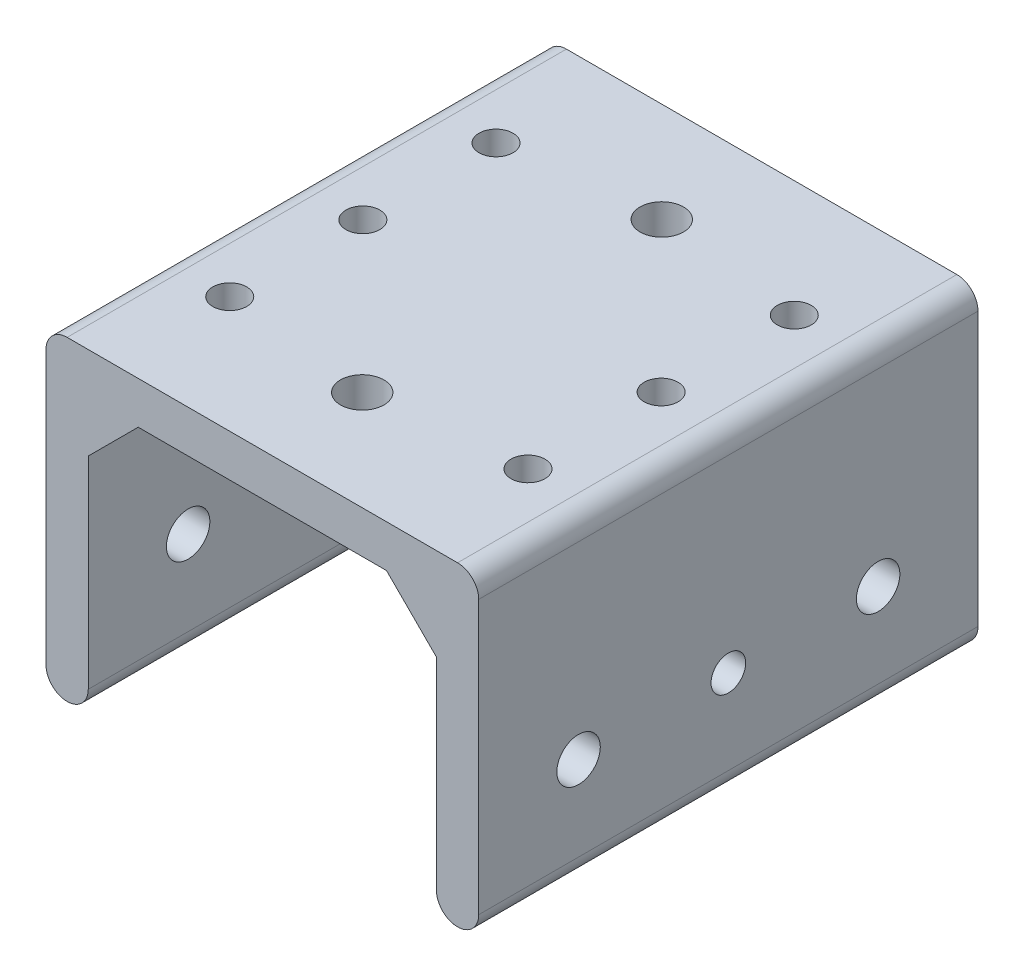
ISO-10303-21;
HEADER;
FILE_DESCRIPTION(('STEP AP214'),'2;1');
FILE_NAME('part.step','',(''),(''),'','','');
FILE_SCHEMA(('AUTOMOTIVE_DESIGN { 1 0 10303 214 1 1 1 1 }'));
ENDSEC;
DATA;
#1=APPLICATION_CONTEXT('core data for automotive mechanical design processes');
#2=APPLICATION_PROTOCOL_DEFINITION('international standard','automotive_design',2000,#1);
#3=PRODUCT_CONTEXT('',#1,'mechanical');
#4=PRODUCT('Part','Part','',(#3));
#5=PRODUCT_RELATED_PRODUCT_CATEGORY('part','',(#4));
#6=PRODUCT_DEFINITION_FORMATION('','',#4);
#7=PRODUCT_DEFINITION_CONTEXT('part definition',#1,'design');
#8=PRODUCT_DEFINITION('design','',#6,#7);
#9=PRODUCT_DEFINITION_SHAPE('','',#8);
#10=(LENGTH_UNIT() NAMED_UNIT(*) SI_UNIT(.MILLI.,.METRE.));
#11=(NAMED_UNIT(*) PLANE_ANGLE_UNIT() SI_UNIT($,.RADIAN.));
#12=(NAMED_UNIT(*) SI_UNIT($,.STERADIAN.) SOLID_ANGLE_UNIT());
#13=UNCERTAINTY_MEASURE_WITH_UNIT(LENGTH_MEASURE(1.E-05),#10,'distance_accuracy_value','');
#14=(GEOMETRIC_REPRESENTATION_CONTEXT(3) GLOBAL_UNCERTAINTY_ASSIGNED_CONTEXT((#13)) GLOBAL_UNIT_ASSIGNED_CONTEXT((#10,
#11,#12)) REPRESENTATION_CONTEXT('',''));
#15=CARTESIAN_POINT('',(0.,0.,0.));
#16=DIRECTION('',(0.,0.,1.));
#17=DIRECTION('',(1.,0.,0.));
#18=AXIS2_PLACEMENT_3D('',#15,#16,#17);
#19=CARTESIAN_POINT('',(6.35,0.,75.));
#20=DIRECTION('',(-1.,0.,0.));
#21=DIRECTION('',(0.,0.,1.));
#22=AXIS2_PLACEMENT_3D('',#19,#20,#21);
#23=PLANE('',#22);
#24=CARTESIAN_POINT('',(6.35,15.87,37.5));
#25=DIRECTION('',(-1.,0.,0.));
#26=DIRECTION('',(0.,0.,1.));
#27=AXIS2_PLACEMENT_3D('',#24,#25,#26);
#28=CIRCLE('',#27,2.6);
#29=CARTESIAN_POINT('',(6.35,15.87,40.1));
#30=VERTEX_POINT('',#29);
#31=EDGE_CURVE('E633',#30,#30,#28,.T.);
#32=ORIENTED_EDGE('',*,*,#31,.T.);
#33=EDGE_LOOP('',(#32));
#34=FACE_BOUND('',#33,.T.);
#35=CARTESIAN_POINT('',(6.35,15.87,60.));
#36=DIRECTION('',(-1.,0.,0.));
#37=DIRECTION('',(0.,0.,1.));
#38=AXIS2_PLACEMENT_3D('',#35,#36,#37);
#39=CIRCLE('',#38,3.2639);
#40=CARTESIAN_POINT('',(6.35,15.87,63.2639));
#41=VERTEX_POINT('',#40);
#42=EDGE_CURVE('E601',#41,#41,#39,.T.);
#43=ORIENTED_EDGE('',*,*,#42,.T.);
#44=EDGE_LOOP('',(#43));
#45=FACE_BOUND('',#44,.T.);
#46=CARTESIAN_POINT('',(6.35,15.87,15.));
#47=DIRECTION('',(-1.,0.,0.));
#48=DIRECTION('',(0.,0.,1.));
#49=AXIS2_PLACEMENT_3D('',#46,#47,#48);
#50=CIRCLE('',#49,3.2639);
#51=CARTESIAN_POINT('',(6.35,15.87,18.2639));
#52=VERTEX_POINT('',#51);
#53=EDGE_CURVE('E185',#52,#52,#50,.T.);
#54=ORIENTED_EDGE('',*,*,#53,.T.);
#55=EDGE_LOOP('',(#54));
#56=FACE_BOUND('',#55,.T.);
#57=DIRECTION('',(0.,1.,0.));
#58=VECTOR('',#57,1.);
#59=CARTESIAN_POINT('',(6.35,0.,75.));
#60=LINE('',#59,#58);
#61=CARTESIAN_POINT('',(6.35,3.175,75.));
#62=VERTEX_POINT('',#61);
#63=CARTESIAN_POINT('',(6.35,33.52,75.));
#64=VERTEX_POINT('',#63);
#65=EDGE_CURVE('E139',#62,#64,#60,.T.);
#66=ORIENTED_EDGE('',*,*,#65,.F.);
#67=DIRECTION('',(0.,0.,-1.));
#68=VECTOR('',#67,1.);
#69=CARTESIAN_POINT('',(6.35,3.175,75.));
#70=LINE('',#69,#68);
#71=CARTESIAN_POINT('',(6.35,3.175,0.));
#72=VERTEX_POINT('',#71);
#73=EDGE_CURVE('E240',#62,#72,#70,.T.);
#74=ORIENTED_EDGE('',*,*,#73,.T.);
#75=DIRECTION('',(0.,1.,0.));
#76=VECTOR('',#75,1.);
#77=CARTESIAN_POINT('',(6.35,0.,0.));
#78=LINE('',#77,#76);
#79=CARTESIAN_POINT('',(6.35,33.52,0.));
#80=VERTEX_POINT('',#79);
#81=EDGE_CURVE('E154',#72,#80,#78,.T.);
#82=ORIENTED_EDGE('',*,*,#81,.T.);
#83=DIRECTION('',(0.,0.,-1.));
#84=VECTOR('',#83,1.);
#85=CARTESIAN_POINT('',(6.35,33.52,75.));
#86=LINE('',#85,#84);
#87=EDGE_CURVE('E152',#64,#80,#86,.T.);
#88=ORIENTED_EDGE('',*,*,#87,.F.);
#89=EDGE_LOOP('',(#66,#74,#82,#88));
#90=FACE_BOUND('',#89,.T.);
#91=ADVANCED_FACE('F36',(#34,#45,#56,#90),#23,.F.);
#92=CARTESIAN_POINT('',(6.35,33.52,75.));
#93=DIRECTION('',(-0.707106781186548,0.707106781186548,0.));
#94=DIRECTION('',(-0.707106781186548,-0.707106781186548,0.));
#95=AXIS2_PLACEMENT_3D('',#92,#93,#94);
#96=PLANE('',#95);
#97=CARTESIAN_POINT('',(10.1,37.27,57.5));
#98=DIRECTION('',(-0.707106781186548,0.707106781186548,0.));
#99=DIRECTION('',(0.707106781186548,0.707106781186548,0.));
#100=AXIS2_PLACEMENT_3D('',#97,#98,#99);
#101=ELLIPSE('',#100,3.6100629606698,2.5527);
#102=CARTESIAN_POINT('',(12.6527,39.8227,57.5));
#103=VERTEX_POINT('',#102);
#104=EDGE_CURVE('E250',#103,#103,#101,.T.);
#105=ORIENTED_EDGE('',*,*,#104,.T.);
#106=EDGE_LOOP('',(#105));
#107=FACE_BOUND('',#106,.T.);
#108=CARTESIAN_POINT('',(10.1,37.27,37.5));
#109=DIRECTION('',(-0.707106781186548,0.707106781186548,0.));
#110=DIRECTION('',(0.707106781186548,0.707106781186548,0.));
#111=AXIS2_PLACEMENT_3D('',#108,#109,#110);
#112=ELLIPSE('',#111,3.6100629606698,2.5527);
#113=CARTESIAN_POINT('',(12.6527,39.8227,37.5));
#114=VERTEX_POINT('',#113);
#115=EDGE_CURVE('E668',#114,#114,#112,.T.);
#116=ORIENTED_EDGE('',*,*,#115,.T.);
#117=EDGE_LOOP('',(#116));
#118=FACE_BOUND('',#117,.T.);
#119=CARTESIAN_POINT('',(10.1,37.27,17.5));
#120=DIRECTION('',(-0.707106781186548,0.707106781186548,0.));
#121=DIRECTION('',(0.707106781186548,0.707106781186548,0.));
#122=AXIS2_PLACEMENT_3D('',#119,#120,#121);
#123=ELLIPSE('',#122,3.6100629606698,2.5527);
#124=CARTESIAN_POINT('',(12.6527,39.8227,17.5));
#125=VERTEX_POINT('',#124);
#126=EDGE_CURVE('E662',#125,#125,#123,.T.);
#127=ORIENTED_EDGE('',*,*,#126,.T.);
#128=EDGE_LOOP('',(#127));
#129=FACE_BOUND('',#128,.T.);
#130=DIRECTION('',(0.707106781186547,0.707106781186547,0.));
#131=VECTOR('',#130,1.);
#132=CARTESIAN_POINT('',(6.35,33.52,0.));
#133=LINE('',#132,#131);
#134=CARTESIAN_POINT('',(13.85,41.02,0.));
#135=VERTEX_POINT('',#134);
#136=EDGE_CURVE('E184',#80,#135,#133,.T.);
#137=ORIENTED_EDGE('',*,*,#136,.T.);
#138=DIRECTION('',(0.,0.,-1.));
#139=VECTOR('',#138,1.);
#140=CARTESIAN_POINT('',(13.85,41.02,75.));
#141=LINE('',#140,#139);
#142=CARTESIAN_POINT('',(13.85,41.02,75.));
#143=VERTEX_POINT('',#142);
#144=EDGE_CURVE('E158',#143,#135,#141,.T.);
#145=ORIENTED_EDGE('',*,*,#144,.F.);
#146=DIRECTION('',(0.707106781186547,0.707106781186547,0.));
#147=VECTOR('',#146,1.);
#148=CARTESIAN_POINT('',(6.35,33.52,75.));
#149=LINE('',#148,#147);
#150=EDGE_CURVE('E143',#64,#143,#149,.T.);
#151=ORIENTED_EDGE('',*,*,#150,.F.);
#152=ORIENTED_EDGE('',*,*,#87,.T.);
#153=EDGE_LOOP('',(#137,#145,#151,#152));
#154=FACE_BOUND('',#153,.T.);
#155=ADVANCED_FACE('F160',(#107,#118,#129,#154),#96,.F.);
#156=CARTESIAN_POINT('',(13.85,41.02,75.));
#157=DIRECTION('',(0.,1.,0.));
#158=DIRECTION('',(0.,0.,1.));
#159=AXIS2_PLACEMENT_3D('',#156,#157,#158);
#160=PLANE('',#159);
#161=CARTESIAN_POINT('',(32.5,41.02,15.));
#162=DIRECTION('',(0.,1.,0.));
#163=DIRECTION('',(0.,0.,1.));
#164=AXIS2_PLACEMENT_3D('',#161,#162,#163);
#165=CIRCLE('',#164,3.2639);
#166=CARTESIAN_POINT('',(32.5,41.02,18.2639));
#167=VERTEX_POINT('',#166);
#168=EDGE_CURVE('E627',#167,#167,#165,.T.);
#169=ORIENTED_EDGE('',*,*,#168,.T.);
#170=EDGE_LOOP('',(#169));
#171=FACE_BOUND('',#170,.T.);
#172=CARTESIAN_POINT('',(32.5,41.02,60.));
#173=DIRECTION('',(0.,1.,0.));
#174=DIRECTION('',(0.,0.,1.));
#175=AXIS2_PLACEMENT_3D('',#172,#173,#174);
#176=CIRCLE('',#175,3.2639);
#177=CARTESIAN_POINT('',(32.5,41.02,63.2639));
#178=VERTEX_POINT('',#177);
#179=EDGE_CURVE('E621',#178,#178,#176,.T.);
#180=ORIENTED_EDGE('',*,*,#179,.T.);
#181=EDGE_LOOP('',(#180));
#182=FACE_BOUND('',#181,.T.);
#183=DIRECTION('',(1.,0.,0.));
#184=VECTOR('',#183,1.);
#185=CARTESIAN_POINT('',(13.85,41.02,0.));
#186=LINE('',#185,#184);
#187=CARTESIAN_POINT('',(51.15,41.02,0.));
#188=VERTEX_POINT('',#187);
#189=EDGE_CURVE('E187',#135,#188,#186,.T.);
#190=ORIENTED_EDGE('',*,*,#189,.T.);
#191=DIRECTION('',(0.,0.,-1.));
#192=VECTOR('',#191,1.);
#193=CARTESIAN_POINT('',(51.15,41.02,75.));
#194=LINE('',#193,#192);
#195=CARTESIAN_POINT('',(51.15,41.02,75.));
#196=VERTEX_POINT('',#195);
#197=EDGE_CURVE('E205',#196,#188,#194,.T.);
#198=ORIENTED_EDGE('',*,*,#197,.F.);
#199=DIRECTION('',(1.,0.,0.));
#200=VECTOR('',#199,1.);
#201=CARTESIAN_POINT('',(13.85,41.02,75.));
#202=LINE('',#201,#200);
#203=EDGE_CURVE('E163',#143,#196,#202,.T.);
#204=ORIENTED_EDGE('',*,*,#203,.F.);
#205=ORIENTED_EDGE('',*,*,#144,.T.);
#206=EDGE_LOOP('',(#190,#198,#204,#205));
#207=FACE_BOUND('',#206,.T.);
#208=ADVANCED_FACE('F263',(#171,#182,#207),#160,.F.);
#209=CARTESIAN_POINT('',(58.65,33.52,75.));
#210=DIRECTION('',(-0.707106781186548,-0.707106781186548,0.));
#211=DIRECTION('',(0.707106781186548,-0.707106781186548,0.));
#212=AXIS2_PLACEMENT_3D('',#209,#210,#211);
#213=PLANE('',#212);
#214=CARTESIAN_POINT('',(54.9,37.27,57.5));
#215=DIRECTION('',(-0.707106781186548,-0.707106781186548,0.));
#216=DIRECTION('',(-0.707106781186548,0.707106781186548,0.));
#217=AXIS2_PLACEMENT_3D('',#214,#215,#216);
#218=ELLIPSE('',#217,3.6100629606698,2.5527);
#219=CARTESIAN_POINT('',(52.3473,39.8227,57.5));
#220=VERTEX_POINT('',#219);
#221=EDGE_CURVE('E656',#220,#220,#218,.T.);
#222=ORIENTED_EDGE('',*,*,#221,.F.);
#223=EDGE_LOOP('',(#222));
#224=FACE_BOUND('',#223,.T.);
#225=CARTESIAN_POINT('',(54.9,37.27,37.5));
#226=DIRECTION('',(-0.707106781186548,-0.707106781186548,0.));
#227=DIRECTION('',(-0.707106781186548,0.707106781186548,0.));
#228=AXIS2_PLACEMENT_3D('',#225,#226,#227);
#229=ELLIPSE('',#228,3.6100629606698,2.5527);
#230=CARTESIAN_POINT('',(52.3473,39.8227,37.5));
#231=VERTEX_POINT('',#230);
#232=EDGE_CURVE('E650',#231,#231,#229,.T.);
#233=ORIENTED_EDGE('',*,*,#232,.F.);
#234=EDGE_LOOP('',(#233));
#235=FACE_BOUND('',#234,.T.);
#236=CARTESIAN_POINT('',(54.9,37.27,17.5));
#237=DIRECTION('',(-0.707106781186548,-0.707106781186548,0.));
#238=DIRECTION('',(-0.707106781186548,0.707106781186548,0.));
#239=AXIS2_PLACEMENT_3D('',#236,#237,#238);
#240=ELLIPSE('',#239,3.6100629606698,2.5527);
#241=CARTESIAN_POINT('',(52.3473,39.8227,17.5));
#242=VERTEX_POINT('',#241);
#243=EDGE_CURVE('E642',#242,#242,#240,.T.);
#244=ORIENTED_EDGE('',*,*,#243,.F.);
#245=EDGE_LOOP('',(#244));
#246=FACE_BOUND('',#245,.T.);
#247=DIRECTION('',(-0.707106781186547,0.707106781186547,0.));
#248=VECTOR('',#247,1.);
#249=CARTESIAN_POINT('',(58.65,33.52,0.));
#250=LINE('',#249,#248);
#251=CARTESIAN_POINT('',(58.65,33.52,0.));
#252=VERTEX_POINT('',#251);
#253=EDGE_CURVE('E190',#252,#188,#250,.T.);
#254=ORIENTED_EDGE('',*,*,#253,.F.);
#255=DIRECTION('',(0.,0.,-1.));
#256=VECTOR('',#255,1.);
#257=CARTESIAN_POINT('',(58.65,33.52,75.));
#258=LINE('',#257,#256);
#259=CARTESIAN_POINT('',(58.65,33.52,75.));
#260=VERTEX_POINT('',#259);
#261=EDGE_CURVE('E182',#260,#252,#258,.T.);
#262=ORIENTED_EDGE('',*,*,#261,.F.);
#263=DIRECTION('',(-0.707106781186547,0.707106781186547,0.));
#264=VECTOR('',#263,1.);
#265=CARTESIAN_POINT('',(58.65,33.52,75.));
#266=LINE('',#265,#264);
#267=EDGE_CURVE('E165',#260,#196,#266,.T.);
#268=ORIENTED_EDGE('',*,*,#267,.T.);
#269=ORIENTED_EDGE('',*,*,#197,.T.);
#270=EDGE_LOOP('',(#254,#262,#268,#269));
#271=FACE_BOUND('',#270,.T.);
#272=ADVANCED_FACE('F270',(#224,#235,#246,#271),#213,.T.);
#273=CARTESIAN_POINT('',(58.65,33.52,75.));
#274=DIRECTION('',(1.,0.,0.));
#275=DIRECTION('',(0.,1.,0.));
#276=AXIS2_PLACEMENT_3D('',#273,#274,#275);
#277=PLANE('',#276);
#278=CARTESIAN_POINT('',(58.65,15.87,37.5));
#279=DIRECTION('',(1.,0.,0.));
#280=DIRECTION('',(0.,1.,0.));
#281=AXIS2_PLACEMENT_3D('',#278,#279,#280);
#282=CIRCLE('',#281,2.6);
#283=CARTESIAN_POINT('',(58.65,18.47,37.5));
#284=VERTEX_POINT('',#283);
#285=EDGE_CURVE('E635',#284,#284,#282,.T.);
#286=ORIENTED_EDGE('',*,*,#285,.T.);
#287=EDGE_LOOP('',(#286));
#288=FACE_BOUND('',#287,.T.);
#289=CARTESIAN_POINT('',(58.65,15.87,60.));
#290=DIRECTION('',(1.,0.,0.));
#291=DIRECTION('',(0.,1.,0.));
#292=AXIS2_PLACEMENT_3D('',#289,#290,#291);
#293=CIRCLE('',#292,3.2639);
#294=CARTESIAN_POINT('',(58.65,19.1339,60.));
#295=VERTEX_POINT('',#294);
#296=EDGE_CURVE('E615',#295,#295,#293,.T.);
#297=ORIENTED_EDGE('',*,*,#296,.T.);
#298=EDGE_LOOP('',(#297));
#299=FACE_BOUND('',#298,.T.);
#300=CARTESIAN_POINT('',(58.65,15.87,15.));
#301=DIRECTION('',(1.,0.,0.));
#302=DIRECTION('',(0.,1.,0.));
#303=AXIS2_PLACEMENT_3D('',#300,#301,#302);
#304=CIRCLE('',#303,3.2639);
#305=CARTESIAN_POINT('',(58.65,19.1339,15.));
#306=VERTEX_POINT('',#305);
#307=EDGE_CURVE('E609',#306,#306,#304,.T.);
#308=ORIENTED_EDGE('',*,*,#307,.T.);
#309=EDGE_LOOP('',(#308));
#310=FACE_BOUND('',#309,.T.);
#311=DIRECTION('',(0.,-1.,0.));
#312=VECTOR('',#311,1.);
#313=CARTESIAN_POINT('',(58.65,33.52,0.));
#314=LINE('',#313,#312);
#315=CARTESIAN_POINT('',(58.65,3.175,0.));
#316=VERTEX_POINT('',#315);
#317=EDGE_CURVE('E193',#252,#316,#314,.T.);
#318=ORIENTED_EDGE('',*,*,#317,.T.);
#319=DIRECTION('',(0.,0.,-1.));
#320=VECTOR('',#319,1.);
#321=CARTESIAN_POINT('',(58.65,3.175,75.));
#322=LINE('',#321,#320);
#323=CARTESIAN_POINT('',(58.65,3.175,75.));
#324=VERTEX_POINT('',#323);
#325=EDGE_CURVE('E233',#316,#324,#322,.F.);
#326=ORIENTED_EDGE('',*,*,#325,.T.);
#327=DIRECTION('',(0.,-1.,0.));
#328=VECTOR('',#327,1.);
#329=CARTESIAN_POINT('',(58.65,33.52,75.));
#330=LINE('',#329,#328);
#331=EDGE_CURVE('E171',#260,#324,#330,.T.);
#332=ORIENTED_EDGE('',*,*,#331,.F.);
#333=ORIENTED_EDGE('',*,*,#261,.T.);
#334=EDGE_LOOP('',(#318,#326,#332,#333));
#335=FACE_BOUND('',#334,.T.);
#336=ADVANCED_FACE('F273',(#288,#299,#310,#335),#277,.F.);
#337=CARTESIAN_POINT('',(65.,41.02,75.));
#338=DIRECTION('',(-1.,0.,0.));
#339=DIRECTION('',(0.,0.,1.));
#340=AXIS2_PLACEMENT_3D('',#337,#338,#339);
#341=PLANE('',#340);
#342=CARTESIAN_POINT('',(65.,15.87,37.5));
#343=DIRECTION('',(-1.,0.,0.));
#344=DIRECTION('',(0.,0.,1.));
#345=AXIS2_PLACEMENT_3D('',#342,#343,#344);
#346=CIRCLE('',#345,2.6);
#347=CARTESIAN_POINT('',(65.,15.87,40.1));
#348=VERTEX_POINT('',#347);
#349=EDGE_CURVE('E638',#348,#348,#346,.T.);
#350=ORIENTED_EDGE('',*,*,#349,.T.);
#351=EDGE_LOOP('',(#350));
#352=FACE_BOUND('',#351,.T.);
#353=CARTESIAN_POINT('',(65.,15.87,60.));
#354=DIRECTION('',(1.,0.,0.));
#355=DIRECTION('',(0.,0.,-1.));
#356=AXIS2_PLACEMENT_3D('',#353,#354,#355);
#357=CIRCLE('',#356,3.26389999999999);
#358=CARTESIAN_POINT('',(65.,15.87,56.7361));
#359=VERTEX_POINT('',#358);
#360=EDGE_CURVE('E618',#359,#359,#357,.T.);
#361=ORIENTED_EDGE('',*,*,#360,.F.);
#362=EDGE_LOOP('',(#361));
#363=FACE_BOUND('',#362,.T.);
#364=CARTESIAN_POINT('',(65.,15.87,15.));
#365=DIRECTION('',(1.,0.,0.));
#366=DIRECTION('',(0.,0.,-1.));
#367=AXIS2_PLACEMENT_3D('',#364,#365,#366);
#368=CIRCLE('',#367,3.26389999999999);
#369=CARTESIAN_POINT('',(65.,15.87,11.7361));
#370=VERTEX_POINT('',#369);
#371=EDGE_CURVE('E612',#370,#370,#368,.T.);
#372=ORIENTED_EDGE('',*,*,#371,.F.);
#373=EDGE_LOOP('',(#372));
#374=FACE_BOUND('',#373,.T.);
#375=DIRECTION('',(0.,-1.,0.));
#376=VECTOR('',#375,1.);
#377=CARTESIAN_POINT('',(65.,41.02,75.));
#378=LINE('',#377,#376);
#379=CARTESIAN_POINT('',(65.,44.195,75.));
#380=VERTEX_POINT('',#379);
#381=CARTESIAN_POINT('',(65.,3.175,75.));
#382=VERTEX_POINT('',#381);
#383=EDGE_CURVE('E174',#380,#382,#378,.T.);
#384=ORIENTED_EDGE('',*,*,#383,.T.);
#385=DIRECTION('',(0.,0.,-1.));
#386=VECTOR('',#385,1.);
#387=CARTESIAN_POINT('',(65.,3.175,0.));
#388=LINE('',#387,#386);
#389=CARTESIAN_POINT('',(65.,3.175,0.));
#390=VERTEX_POINT('',#389);
#391=EDGE_CURVE('E209',#382,#390,#388,.T.);
#392=ORIENTED_EDGE('',*,*,#391,.T.);
#393=DIRECTION('',(0.,1.,0.));
#394=VECTOR('',#393,1.);
#395=CARTESIAN_POINT('',(65.,41.02,0.));
#396=LINE('',#395,#394);
#397=CARTESIAN_POINT('',(65.,44.195,0.));
#398=VERTEX_POINT('',#397);
#399=EDGE_CURVE('E196',#390,#398,#396,.T.);
#400=ORIENTED_EDGE('',*,*,#399,.T.);
#401=DIRECTION('',(0.,0.,-1.));
#402=VECTOR('',#401,1.);
#403=CARTESIAN_POINT('',(65.,44.195,75.));
#404=LINE('',#403,#402);
#405=EDGE_CURVE('E157',#398,#380,#404,.F.);
#406=ORIENTED_EDGE('',*,*,#405,.T.);
#407=EDGE_LOOP('',(#384,#392,#400,#406));
#408=FACE_BOUND('',#407,.T.);
#409=ADVANCED_FACE('F282',(#352,#363,#374,#408),#341,.F.);
#410=CARTESIAN_POINT('',(0.,47.37,75.));
#411=DIRECTION('',(0.,1.,0.));
#412=DIRECTION('',(0.,0.,1.));
#413=AXIS2_PLACEMENT_3D('',#410,#411,#412);
#414=PLANE('',#413);
#415=CARTESIAN_POINT('',(10.1,47.37,57.5));
#416=DIRECTION('',(0.,1.,0.));
#417=DIRECTION('',(0.,0.,1.));
#418=AXIS2_PLACEMENT_3D('',#415,#416,#417);
#419=CIRCLE('',#418,2.5527);
#420=CARTESIAN_POINT('',(10.1,47.37,60.0527));
#421=VERTEX_POINT('',#420);
#422=EDGE_CURVE('E245',#421,#421,#419,.T.);
#423=ORIENTED_EDGE('',*,*,#422,.F.);
#424=EDGE_LOOP('',(#423));
#425=FACE_BOUND('',#424,.T.);
#426=CARTESIAN_POINT('',(10.1,47.37,37.5));
#427=DIRECTION('',(0.,1.,0.));
#428=DIRECTION('',(0.,0.,1.));
#429=AXIS2_PLACEMENT_3D('',#426,#427,#428);
#430=CIRCLE('',#429,2.5527);
#431=CARTESIAN_POINT('',(10.1,47.37,40.0527));
#432=VERTEX_POINT('',#431);
#433=EDGE_CURVE('E671',#432,#432,#430,.T.);
#434=ORIENTED_EDGE('',*,*,#433,.F.);
#435=EDGE_LOOP('',(#434));
#436=FACE_BOUND('',#435,.T.);
#437=CARTESIAN_POINT('',(10.1,47.37,17.5));
#438=DIRECTION('',(0.,1.,0.));
#439=DIRECTION('',(0.,0.,1.));
#440=AXIS2_PLACEMENT_3D('',#437,#438,#439);
#441=CIRCLE('',#440,2.5527);
#442=CARTESIAN_POINT('',(10.1,47.37,20.0527));
#443=VERTEX_POINT('',#442);
#444=EDGE_CURVE('E665',#443,#443,#441,.T.);
#445=ORIENTED_EDGE('',*,*,#444,.F.);
#446=EDGE_LOOP('',(#445));
#447=FACE_BOUND('',#446,.T.);
#448=CARTESIAN_POINT('',(54.9,47.37,57.5));
#449=DIRECTION('',(0.,1.,0.));
#450=DIRECTION('',(0.,0.,1.));
#451=AXIS2_PLACEMENT_3D('',#448,#449,#450);
#452=CIRCLE('',#451,2.5527);
#453=CARTESIAN_POINT('',(54.9,47.37,60.0527));
#454=VERTEX_POINT('',#453);
#455=EDGE_CURVE('E659',#454,#454,#452,.T.);
#456=ORIENTED_EDGE('',*,*,#455,.F.);
#457=EDGE_LOOP('',(#456));
#458=FACE_BOUND('',#457,.T.);
#459=CARTESIAN_POINT('',(54.9,47.37,37.5));
#460=DIRECTION('',(0.,1.,0.));
#461=DIRECTION('',(0.,0.,1.));
#462=AXIS2_PLACEMENT_3D('',#459,#460,#461);
#463=CIRCLE('',#462,2.5527);
#464=CARTESIAN_POINT('',(54.9,47.37,40.0527));
#465=VERTEX_POINT('',#464);
#466=EDGE_CURVE('E653',#465,#465,#463,.T.);
#467=ORIENTED_EDGE('',*,*,#466,.F.);
#468=EDGE_LOOP('',(#467));
#469=FACE_BOUND('',#468,.T.);
#470=CARTESIAN_POINT('',(54.9,47.37,17.5));
#471=DIRECTION('',(0.,1.,0.));
#472=DIRECTION('',(0.,0.,1.));
#473=AXIS2_PLACEMENT_3D('',#470,#471,#472);
#474=CIRCLE('',#473,2.5527);
#475=CARTESIAN_POINT('',(54.9,47.37,20.0527));
#476=VERTEX_POINT('',#475);
#477=EDGE_CURVE('E647',#476,#476,#474,.T.);
#478=ORIENTED_EDGE('',*,*,#477,.F.);
#479=EDGE_LOOP('',(#478));
#480=FACE_BOUND('',#479,.T.);
#481=CARTESIAN_POINT('',(32.5,47.37,15.));
#482=DIRECTION('',(0.,1.,0.));
#483=DIRECTION('',(0.,0.,1.));
#484=AXIS2_PLACEMENT_3D('',#481,#482,#483);
#485=CIRCLE('',#484,3.2639);
#486=CARTESIAN_POINT('',(32.5,47.37,18.2639));
#487=VERTEX_POINT('',#486);
#488=EDGE_CURVE('E630',#487,#487,#485,.T.);
#489=ORIENTED_EDGE('',*,*,#488,.F.);
#490=EDGE_LOOP('',(#489));
#491=FACE_BOUND('',#490,.T.);
#492=CARTESIAN_POINT('',(32.5,47.37,60.));
#493=DIRECTION('',(0.,1.,0.));
#494=DIRECTION('',(0.,0.,1.));
#495=AXIS2_PLACEMENT_3D('',#492,#493,#494);
#496=CIRCLE('',#495,3.2639);
#497=CARTESIAN_POINT('',(32.5,47.37,63.2639));
#498=VERTEX_POINT('',#497);
#499=EDGE_CURVE('E624',#498,#498,#496,.T.);
#500=ORIENTED_EDGE('',*,*,#499,.F.);
#501=EDGE_LOOP('',(#500));
#502=FACE_BOUND('',#501,.T.);
#503=DIRECTION('',(1.,0.,0.));
#504=VECTOR('',#503,1.);
#505=CARTESIAN_POINT('',(0.,47.37,0.));
#506=LINE('',#505,#504);
#507=CARTESIAN_POINT('',(3.175,47.37,0.));
#508=VERTEX_POINT('',#507);
#509=CARTESIAN_POINT('',(61.825,47.37,0.));
#510=VERTEX_POINT('',#509);
#511=EDGE_CURVE('E199',#508,#510,#506,.T.);
#512=ORIENTED_EDGE('',*,*,#511,.F.);
#513=DIRECTION('',(0.,0.,-1.));
#514=VECTOR('',#513,1.);
#515=CARTESIAN_POINT('',(3.175,47.37,75.));
#516=LINE('',#515,#514);
#517=CARTESIAN_POINT('',(3.175,47.37,75.));
#518=VERTEX_POINT('',#517);
#519=EDGE_CURVE('E11',#508,#518,#516,.F.);
#520=ORIENTED_EDGE('',*,*,#519,.T.);
#521=DIRECTION('',(1.,0.,0.));
#522=VECTOR('',#521,1.);
#523=CARTESIAN_POINT('',(0.,47.37,75.));
#524=LINE('',#523,#522);
#525=CARTESIAN_POINT('',(61.825,47.37,75.));
#526=VERTEX_POINT('',#525);
#527=EDGE_CURVE('E177',#518,#526,#524,.T.);
#528=ORIENTED_EDGE('',*,*,#527,.T.);
#529=DIRECTION('',(0.,0.,-1.));
#530=VECTOR('',#529,1.);
#531=CARTESIAN_POINT('',(61.825,47.37,0.));
#532=LINE('',#531,#530);
#533=EDGE_CURVE('E45',#526,#510,#532,.T.);
#534=ORIENTED_EDGE('',*,*,#533,.T.);
#535=EDGE_LOOP('',(#512,#520,#528,#534));
#536=FACE_BOUND('',#535,.T.);
#537=ADVANCED_FACE('F289',(#425,#436,#447,#458,#469,#480,#491,#502,#536),#414,.T.);
#538=CARTESIAN_POINT('',(0.,0.,75.));
#539=DIRECTION('',(-1.,0.,0.));
#540=DIRECTION('',(0.,0.,1.));
#541=AXIS2_PLACEMENT_3D('',#538,#539,#540);
#542=PLANE('',#541);
#543=CARTESIAN_POINT('',(0.,15.87,37.5));
#544=DIRECTION('',(-1.,0.,0.));
#545=DIRECTION('',(0.,0.,1.));
#546=AXIS2_PLACEMENT_3D('',#543,#544,#545);
#547=CIRCLE('',#546,2.6);
#548=CARTESIAN_POINT('',(0.,15.87,40.1));
#549=VERTEX_POINT('',#548);
#550=EDGE_CURVE('E639',#549,#549,#547,.T.);
#551=ORIENTED_EDGE('',*,*,#550,.F.);
#552=EDGE_LOOP('',(#551));
#553=FACE_BOUND('',#552,.T.);
#554=CARTESIAN_POINT('',(0.,15.87,60.));
#555=DIRECTION('',(-1.,0.,0.));
#556=DIRECTION('',(0.,0.,1.));
#557=AXIS2_PLACEMENT_3D('',#554,#555,#556);
#558=CIRCLE('',#557,3.26389999999999);
#559=CARTESIAN_POINT('',(0.,15.87,63.2639));
#560=VERTEX_POINT('',#559);
#561=EDGE_CURVE('E604',#560,#560,#558,.T.);
#562=ORIENTED_EDGE('',*,*,#561,.F.);
#563=EDGE_LOOP('',(#562));
#564=FACE_BOUND('',#563,.T.);
#565=CARTESIAN_POINT('',(0.,15.87,15.));
#566=DIRECTION('',(-1.,0.,0.));
#567=DIRECTION('',(0.,0.,1.));
#568=AXIS2_PLACEMENT_3D('',#565,#566,#567);
#569=CIRCLE('',#568,3.26389999999999);
#570=CARTESIAN_POINT('',(0.,15.87,18.2639));
#571=VERTEX_POINT('',#570);
#572=EDGE_CURVE('E599',#571,#571,#569,.T.);
#573=ORIENTED_EDGE('',*,*,#572,.F.);
#574=EDGE_LOOP('',(#573));
#575=FACE_BOUND('',#574,.T.);
#576=DIRECTION('',(0.,1.,0.));
#577=VECTOR('',#576,1.);
#578=CARTESIAN_POINT('',(0.,0.,0.));
#579=LINE('',#578,#577);
#580=CARTESIAN_POINT('',(0.,3.175,0.));
#581=VERTEX_POINT('',#580);
#582=CARTESIAN_POINT('',(0.,44.195,0.));
#583=VERTEX_POINT('',#582);
#584=EDGE_CURVE('E149',#581,#583,#579,.T.);
#585=ORIENTED_EDGE('',*,*,#584,.F.);
#586=DIRECTION('',(0.,0.,-1.));
#587=VECTOR('',#586,1.);
#588=CARTESIAN_POINT('',(0.,3.175,75.));
#589=LINE('',#588,#587);
#590=CARTESIAN_POINT('',(0.,3.175,75.));
#591=VERTEX_POINT('',#590);
#592=EDGE_CURVE('E238',#581,#591,#589,.F.);
#593=ORIENTED_EDGE('',*,*,#592,.T.);
#594=DIRECTION('',(0.,1.,0.));
#595=VECTOR('',#594,1.);
#596=CARTESIAN_POINT('',(0.,41.02,75.));
#597=LINE('',#596,#595);
#598=CARTESIAN_POINT('',(0.,44.195,75.));
#599=VERTEX_POINT('',#598);
#600=EDGE_CURVE('E180',#591,#599,#597,.T.);
#601=ORIENTED_EDGE('',*,*,#600,.T.);
#602=DIRECTION('',(0.,0.,-1.));
#603=VECTOR('',#602,1.);
#604=CARTESIAN_POINT('',(0.,44.195,75.));
#605=LINE('',#604,#603);
#606=EDGE_CURVE('E235',#599,#583,#605,.T.);
#607=ORIENTED_EDGE('',*,*,#606,.T.);
#608=EDGE_LOOP('',(#585,#593,#601,#607));
#609=FACE_BOUND('',#608,.T.);
#610=ADVANCED_FACE('F296',(#553,#564,#575,#609),#542,.T.);
#611=CARTESIAN_POINT('',(0.,0.,75.));
#612=DIRECTION('',(0.,0.,1.));
#613=DIRECTION('',(1.,0.,0.));
#614=AXIS2_PLACEMENT_3D('',#611,#612,#613);
#615=PLANE('',#614);
#616=CARTESIAN_POINT('',(61.825,3.175,75.));
#617=DIRECTION('',(0.,0.,1.));
#618=DIRECTION('',(1.,0.,0.));
#619=AXIS2_PLACEMENT_3D('',#616,#617,#618);
#620=CIRCLE('',#619,3.175);
#621=CARTESIAN_POINT('',(61.825,0.,75.));
#622=VERTEX_POINT('',#621);
#623=EDGE_CURVE('E229',#324,#622,#620,.T.);
#624=ORIENTED_EDGE('',*,*,#623,.T.);
#625=CARTESIAN_POINT('',(61.825,3.175,75.));
#626=DIRECTION('',(0.,0.,1.));
#627=DIRECTION('',(1.,0.,0.));
#628=AXIS2_PLACEMENT_3D('',#625,#626,#627);
#629=CIRCLE('',#628,3.175);
#630=EDGE_CURVE('E231',#622,#382,#629,.T.);
#631=ORIENTED_EDGE('',*,*,#630,.T.);
#632=ORIENTED_EDGE('',*,*,#383,.F.);
#633=CARTESIAN_POINT('',(61.825,44.195,75.));
#634=DIRECTION('',(0.,0.,1.));
#635=DIRECTION('',(1.,0.,0.));
#636=AXIS2_PLACEMENT_3D('',#633,#634,#635);
#637=CIRCLE('',#636,3.175);
#638=EDGE_CURVE('E224',#380,#526,#637,.T.);
#639=ORIENTED_EDGE('',*,*,#638,.T.);
#640=ORIENTED_EDGE('',*,*,#527,.F.);
#641=CARTESIAN_POINT('',(3.175,44.195,75.));
#642=DIRECTION('',(0.,0.,1.));
#643=DIRECTION('',(1.,0.,0.));
#644=AXIS2_PLACEMENT_3D('',#641,#642,#643);
#645=CIRCLE('',#644,3.175);
#646=EDGE_CURVE('E53',#518,#599,#645,.T.);
#647=ORIENTED_EDGE('',*,*,#646,.T.);
#648=ORIENTED_EDGE('',*,*,#600,.F.);
#649=CARTESIAN_POINT('',(3.175,3.175,75.));
#650=DIRECTION('',(0.,0.,1.));
#651=DIRECTION('',(1.,0.,0.));
#652=AXIS2_PLACEMENT_3D('',#649,#650,#651);
#653=CIRCLE('',#652,3.175);
#654=CARTESIAN_POINT('',(3.175,0.,75.));
#655=VERTEX_POINT('',#654);
#656=EDGE_CURVE('E61',#591,#655,#653,.T.);
#657=ORIENTED_EDGE('',*,*,#656,.T.);
#658=CARTESIAN_POINT('',(3.175,3.175,75.));
#659=DIRECTION('',(0.,0.,1.));
#660=DIRECTION('',(1.,0.,0.));
#661=AXIS2_PLACEMENT_3D('',#658,#659,#660);
#662=CIRCLE('',#661,3.175);
#663=EDGE_CURVE('E146',#655,#62,#662,.T.);
#664=ORIENTED_EDGE('',*,*,#663,.T.);
#665=ORIENTED_EDGE('',*,*,#65,.T.);
#666=ORIENTED_EDGE('',*,*,#150,.T.);
#667=ORIENTED_EDGE('',*,*,#203,.T.);
#668=ORIENTED_EDGE('',*,*,#267,.F.);
#669=ORIENTED_EDGE('',*,*,#331,.T.);
#670=EDGE_LOOP('',(#624,#631,#632,#639,#640,#647,#648,#657,#664,#665,#666,#667,#668,#669));
#671=FACE_BOUND('',#670,.T.);
#672=ADVANCED_FACE('F141',(#671),#615,.T.);
#673=CARTESIAN_POINT('',(0.,0.,0.));
#674=DIRECTION('',(0.,0.,1.));
#675=DIRECTION('',(1.,0.,0.));
#676=AXIS2_PLACEMENT_3D('',#673,#674,#675);
#677=PLANE('',#676);
#678=ORIENTED_EDGE('',*,*,#399,.F.);
#679=CARTESIAN_POINT('',(61.825,3.175,0.));
#680=DIRECTION('',(0.,0.,1.));
#681=DIRECTION('',(1.,0.,0.));
#682=AXIS2_PLACEMENT_3D('',#679,#680,#681);
#683=CIRCLE('',#682,3.175);
#684=CARTESIAN_POINT('',(61.825,0.,0.));
#685=VERTEX_POINT('',#684);
#686=EDGE_CURVE('E222',#390,#685,#683,.F.);
#687=ORIENTED_EDGE('',*,*,#686,.T.);
#688=CARTESIAN_POINT('',(61.825,3.175,0.));
#689=DIRECTION('',(0.,0.,1.));
#690=DIRECTION('',(1.,0.,0.));
#691=AXIS2_PLACEMENT_3D('',#688,#689,#690);
#692=CIRCLE('',#691,3.175);
#693=EDGE_CURVE('E220',#685,#316,#692,.F.);
#694=ORIENTED_EDGE('',*,*,#693,.T.);
#695=ORIENTED_EDGE('',*,*,#317,.F.);
#696=ORIENTED_EDGE('',*,*,#253,.T.);
#697=ORIENTED_EDGE('',*,*,#189,.F.);
#698=ORIENTED_EDGE('',*,*,#136,.F.);
#699=ORIENTED_EDGE('',*,*,#81,.F.);
#700=CARTESIAN_POINT('',(3.175,3.175,0.));
#701=DIRECTION('',(0.,0.,1.));
#702=DIRECTION('',(1.,0.,0.));
#703=AXIS2_PLACEMENT_3D('',#700,#701,#702);
#704=CIRCLE('',#703,3.175);
#705=CARTESIAN_POINT('',(3.175,0.,0.));
#706=VERTEX_POINT('',#705);
#707=EDGE_CURVE('E216',#72,#706,#704,.F.);
#708=ORIENTED_EDGE('',*,*,#707,.T.);
#709=CARTESIAN_POINT('',(3.175,3.175,0.));
#710=DIRECTION('',(0.,0.,1.));
#711=DIRECTION('',(1.,0.,0.));
#712=AXIS2_PLACEMENT_3D('',#709,#710,#711);
#713=CIRCLE('',#712,3.175);
#714=EDGE_CURVE('E218',#706,#581,#713,.F.);
#715=ORIENTED_EDGE('',*,*,#714,.T.);
#716=ORIENTED_EDGE('',*,*,#584,.T.);
#717=CARTESIAN_POINT('',(3.175,44.195,0.));
#718=DIRECTION('',(0.,0.,1.));
#719=DIRECTION('',(1.,0.,0.));
#720=AXIS2_PLACEMENT_3D('',#717,#718,#719);
#721=CIRCLE('',#720,3.175);
#722=EDGE_CURVE('E214',#583,#508,#721,.F.);
#723=ORIENTED_EDGE('',*,*,#722,.T.);
#724=ORIENTED_EDGE('',*,*,#511,.T.);
#725=CARTESIAN_POINT('',(61.825,44.195,0.));
#726=DIRECTION('',(0.,0.,1.));
#727=DIRECTION('',(1.,0.,0.));
#728=AXIS2_PLACEMENT_3D('',#725,#726,#727);
#729=CIRCLE('',#728,3.175);
#730=EDGE_CURVE('E212',#510,#398,#729,.F.);
#731=ORIENTED_EDGE('',*,*,#730,.T.);
#732=EDGE_LOOP('',(#678,#687,#694,#695,#696,#697,#698,#699,#708,#715,#716,#723,#724,#731));
#733=FACE_BOUND('',#732,.T.);
#734=ADVANCED_FACE('F260',(#733),#677,.F.);
#735=CARTESIAN_POINT('',(0.,15.87,15.));
#736=DIRECTION('',(-1.,0.,0.));
#737=DIRECTION('',(0.,0.,1.));
#738=AXIS2_PLACEMENT_3D('',#735,#736,#737);
#739=CYLINDRICAL_SURFACE('',#738,3.2639);
#740=ORIENTED_EDGE('',*,*,#53,.F.);
#741=EDGE_LOOP('',(#740));
#742=FACE_BOUND('',#741,.T.);
#743=ORIENTED_EDGE('',*,*,#572,.T.);
#744=EDGE_LOOP('',(#743));
#745=FACE_BOUND('',#744,.T.);
#746=ADVANCED_FACE('F375',(#742,#745),#739,.F.);
#747=CARTESIAN_POINT('',(0.,15.87,60.));
#748=DIRECTION('',(-1.,0.,0.));
#749=DIRECTION('',(0.,0.,1.));
#750=AXIS2_PLACEMENT_3D('',#747,#748,#749);
#751=CYLINDRICAL_SURFACE('',#750,3.2639);
#752=ORIENTED_EDGE('',*,*,#42,.F.);
#753=EDGE_LOOP('',(#752));
#754=FACE_BOUND('',#753,.T.);
#755=ORIENTED_EDGE('',*,*,#561,.T.);
#756=EDGE_LOOP('',(#755));
#757=FACE_BOUND('',#756,.T.);
#758=ADVANCED_FACE('F565',(#754,#757),#751,.F.);
#759=CARTESIAN_POINT('',(65.,15.87,15.));
#760=DIRECTION('',(1.,0.,0.));
#761=DIRECTION('',(0.,0.,-1.));
#762=AXIS2_PLACEMENT_3D('',#759,#760,#761);
#763=CYLINDRICAL_SURFACE('',#762,3.2639);
#764=ORIENTED_EDGE('',*,*,#307,.F.);
#765=EDGE_LOOP('',(#764));
#766=FACE_BOUND('',#765,.T.);
#767=ORIENTED_EDGE('',*,*,#371,.T.);
#768=EDGE_LOOP('',(#767));
#769=FACE_BOUND('',#768,.T.);
#770=ADVANCED_FACE('F554',(#766,#769),#763,.F.);
#771=CARTESIAN_POINT('',(65.,15.87,60.));
#772=DIRECTION('',(1.,0.,0.));
#773=DIRECTION('',(0.,0.,-1.));
#774=AXIS2_PLACEMENT_3D('',#771,#772,#773);
#775=CYLINDRICAL_SURFACE('',#774,3.2639);
#776=ORIENTED_EDGE('',*,*,#296,.F.);
#777=EDGE_LOOP('',(#776));
#778=FACE_BOUND('',#777,.T.);
#779=ORIENTED_EDGE('',*,*,#360,.T.);
#780=EDGE_LOOP('',(#779));
#781=FACE_BOUND('',#780,.T.);
#782=ADVANCED_FACE('F538',(#778,#781),#775,.F.);
#783=CARTESIAN_POINT('',(32.5,47.37,60.));
#784=DIRECTION('',(0.,1.,0.));
#785=DIRECTION('',(0.,0.,1.));
#786=AXIS2_PLACEMENT_3D('',#783,#784,#785);
#787=CYLINDRICAL_SURFACE('',#786,3.2639);
#788=ORIENTED_EDGE('',*,*,#179,.F.);
#789=EDGE_LOOP('',(#788));
#790=FACE_BOUND('',#789,.T.);
#791=ORIENTED_EDGE('',*,*,#499,.T.);
#792=EDGE_LOOP('',(#791));
#793=FACE_BOUND('',#792,.T.);
#794=ADVANCED_FACE('F527',(#790,#793),#787,.F.);
#795=CARTESIAN_POINT('',(32.5,47.37,15.));
#796=DIRECTION('',(0.,1.,0.));
#797=DIRECTION('',(0.,0.,1.));
#798=AXIS2_PLACEMENT_3D('',#795,#796,#797);
#799=CYLINDRICAL_SURFACE('',#798,3.2639);
#800=ORIENTED_EDGE('',*,*,#168,.F.);
#801=EDGE_LOOP('',(#800));
#802=FACE_BOUND('',#801,.T.);
#803=ORIENTED_EDGE('',*,*,#488,.T.);
#804=EDGE_LOOP('',(#803));
#805=FACE_BOUND('',#804,.T.);
#806=ADVANCED_FACE('F517',(#802,#805),#799,.F.);
#807=CARTESIAN_POINT('',(65.,15.87,37.5));
#808=DIRECTION('',(-1.,0.,0.));
#809=DIRECTION('',(0.,0.,1.));
#810=AXIS2_PLACEMENT_3D('',#807,#808,#809);
#811=CYLINDRICAL_SURFACE('',#810,2.6);
#812=ORIENTED_EDGE('',*,*,#550,.T.);
#813=EDGE_LOOP('',(#812));
#814=FACE_BOUND('',#813,.T.);
#815=ORIENTED_EDGE('',*,*,#31,.F.);
#816=EDGE_LOOP('',(#815));
#817=FACE_BOUND('',#816,.T.);
#818=ADVANCED_FACE('F507',(#814,#817),#811,.F.);
#819=ORIENTED_EDGE('',*,*,#349,.F.);
#820=EDGE_LOOP('',(#819));
#821=FACE_BOUND('',#820,.T.);
#822=ORIENTED_EDGE('',*,*,#285,.F.);
#823=EDGE_LOOP('',(#822));
#824=FACE_BOUND('',#823,.T.);
#825=ADVANCED_FACE('F490',(#821,#824),#811,.F.);
#826=CARTESIAN_POINT('',(54.9,47.37,17.5));
#827=DIRECTION('',(0.,1.,0.));
#828=DIRECTION('',(0.,0.,1.));
#829=AXIS2_PLACEMENT_3D('',#826,#827,#828);
#830=CYLINDRICAL_SURFACE('',#829,2.5527);
#831=ORIENTED_EDGE('',*,*,#477,.T.);
#832=EDGE_LOOP('',(#831));
#833=FACE_BOUND('',#832,.T.);
#834=ORIENTED_EDGE('',*,*,#243,.T.);
#835=EDGE_LOOP('',(#834));
#836=FACE_BOUND('',#835,.T.);
#837=ADVANCED_FACE('F480',(#833,#836),#830,.F.);
#838=CARTESIAN_POINT('',(54.9,47.37,37.5));
#839=DIRECTION('',(0.,1.,0.));
#840=DIRECTION('',(0.,0.,1.));
#841=AXIS2_PLACEMENT_3D('',#838,#839,#840);
#842=CYLINDRICAL_SURFACE('',#841,2.5527);
#843=ORIENTED_EDGE('',*,*,#466,.T.);
#844=EDGE_LOOP('',(#843));
#845=FACE_BOUND('',#844,.T.);
#846=ORIENTED_EDGE('',*,*,#232,.T.);
#847=EDGE_LOOP('',(#846));
#848=FACE_BOUND('',#847,.T.);
#849=ADVANCED_FACE('F468',(#845,#848),#842,.F.);
#850=CARTESIAN_POINT('',(54.9,47.37,57.5));
#851=DIRECTION('',(0.,1.,0.));
#852=DIRECTION('',(0.,0.,1.));
#853=AXIS2_PLACEMENT_3D('',#850,#851,#852);
#854=CYLINDRICAL_SURFACE('',#853,2.5527);
#855=ORIENTED_EDGE('',*,*,#455,.T.);
#856=EDGE_LOOP('',(#855));
#857=FACE_BOUND('',#856,.T.);
#858=ORIENTED_EDGE('',*,*,#221,.T.);
#859=EDGE_LOOP('',(#858));
#860=FACE_BOUND('',#859,.T.);
#861=ADVANCED_FACE('F450',(#857,#860),#854,.F.);
#862=CARTESIAN_POINT('',(10.1,47.37,17.5));
#863=DIRECTION('',(0.,1.,0.));
#864=DIRECTION('',(0.,0.,1.));
#865=AXIS2_PLACEMENT_3D('',#862,#863,#864);
#866=CYLINDRICAL_SURFACE('',#865,2.5527);
#867=ORIENTED_EDGE('',*,*,#126,.F.);
#868=EDGE_LOOP('',(#867));
#869=FACE_BOUND('',#868,.T.);
#870=ORIENTED_EDGE('',*,*,#444,.T.);
#871=EDGE_LOOP('',(#870));
#872=FACE_BOUND('',#871,.T.);
#873=ADVANCED_FACE('F439',(#869,#872),#866,.F.);
#874=CARTESIAN_POINT('',(10.1,47.37,37.5));
#875=DIRECTION('',(0.,1.,0.));
#876=DIRECTION('',(0.,0.,1.));
#877=AXIS2_PLACEMENT_3D('',#874,#875,#876);
#878=CYLINDRICAL_SURFACE('',#877,2.5527);
#879=ORIENTED_EDGE('',*,*,#115,.F.);
#880=EDGE_LOOP('',(#879));
#881=FACE_BOUND('',#880,.T.);
#882=ORIENTED_EDGE('',*,*,#433,.T.);
#883=EDGE_LOOP('',(#882));
#884=FACE_BOUND('',#883,.T.);
#885=ADVANCED_FACE('F427',(#881,#884),#878,.F.);
#886=CARTESIAN_POINT('',(10.1,47.37,57.5));
#887=DIRECTION('',(0.,1.,0.));
#888=DIRECTION('',(0.,0.,1.));
#889=AXIS2_PLACEMENT_3D('',#886,#887,#888);
#890=CYLINDRICAL_SURFACE('',#889,2.5527);
#891=ORIENTED_EDGE('',*,*,#104,.F.);
#892=EDGE_LOOP('',(#891));
#893=FACE_BOUND('',#892,.T.);
#894=ORIENTED_EDGE('',*,*,#422,.T.);
#895=EDGE_LOOP('',(#894));
#896=FACE_BOUND('',#895,.T.);
#897=ADVANCED_FACE('F326',(#893,#896),#890,.F.);
#898=CARTESIAN_POINT('',(61.825,3.175,75.));
#899=DIRECTION('',(0.,0.,1.));
#900=DIRECTION('',(1.,0.,0.));
#901=AXIS2_PLACEMENT_3D('',#898,#899,#900);
#902=CYLINDRICAL_SURFACE('',#901,3.175);
#903=DIRECTION('',(0.,0.,-1.));
#904=VECTOR('',#903,1.);
#905=CARTESIAN_POINT('',(61.825,0.,0.));
#906=LINE('',#905,#904);
#907=EDGE_CURVE('E243',#622,#685,#906,.T.);
#908=ORIENTED_EDGE('',*,*,#907,.F.);
#909=ORIENTED_EDGE('',*,*,#623,.F.);
#910=ORIENTED_EDGE('',*,*,#325,.F.);
#911=ORIENTED_EDGE('',*,*,#693,.F.);
#912=EDGE_LOOP('',(#908,#909,#910,#911));
#913=FACE_BOUND('',#912,.T.);
#914=ADVANCED_FACE('F277',(#913),#902,.T.);
#915=CARTESIAN_POINT('',(61.825,3.175,75.));
#916=DIRECTION('',(0.,0.,1.));
#917=DIRECTION('',(1.,0.,0.));
#918=AXIS2_PLACEMENT_3D('',#915,#916,#917);
#919=CYLINDRICAL_SURFACE('',#918,3.175);
#920=ORIENTED_EDGE('',*,*,#630,.F.);
#921=ORIENTED_EDGE('',*,*,#907,.T.);
#922=ORIENTED_EDGE('',*,*,#686,.F.);
#923=ORIENTED_EDGE('',*,*,#391,.F.);
#924=EDGE_LOOP('',(#920,#921,#922,#923));
#925=FACE_BOUND('',#924,.T.);
#926=ADVANCED_FACE('F284',(#925),#919,.T.);
#927=CARTESIAN_POINT('',(3.175,3.175,75.));
#928=DIRECTION('',(0.,0.,-1.));
#929=DIRECTION('',(-1.,0.,0.));
#930=AXIS2_PLACEMENT_3D('',#927,#928,#929);
#931=CYLINDRICAL_SURFACE('',#930,3.175);
#932=ORIENTED_EDGE('',*,*,#73,.F.);
#933=ORIENTED_EDGE('',*,*,#663,.F.);
#934=DIRECTION('',(0.,0.,-1.));
#935=VECTOR('',#934,1.);
#936=CARTESIAN_POINT('',(3.175,0.,75.));
#937=LINE('',#936,#935);
#938=EDGE_CURVE('E40',#706,#655,#937,.F.);
#939=ORIENTED_EDGE('',*,*,#938,.F.);
#940=ORIENTED_EDGE('',*,*,#707,.F.);
#941=EDGE_LOOP('',(#932,#933,#939,#940));
#942=FACE_BOUND('',#941,.T.);
#943=ADVANCED_FACE('F257',(#942),#931,.T.);
#944=CARTESIAN_POINT('',(3.175,3.175,75.));
#945=DIRECTION('',(0.,0.,1.));
#946=DIRECTION('',(1.,0.,0.));
#947=AXIS2_PLACEMENT_3D('',#944,#945,#946);
#948=CYLINDRICAL_SURFACE('',#947,3.175);
#949=ORIENTED_EDGE('',*,*,#656,.F.);
#950=ORIENTED_EDGE('',*,*,#592,.F.);
#951=ORIENTED_EDGE('',*,*,#714,.F.);
#952=ORIENTED_EDGE('',*,*,#938,.T.);
#953=EDGE_LOOP('',(#949,#950,#951,#952));
#954=FACE_BOUND('',#953,.T.);
#955=ADVANCED_FACE('F254',(#954),#948,.T.);
#956=CARTESIAN_POINT('',(3.175,44.195,75.));
#957=DIRECTION('',(0.,0.,-1.));
#958=DIRECTION('',(-1.,0.,0.));
#959=AXIS2_PLACEMENT_3D('',#956,#957,#958);
#960=CYLINDRICAL_SURFACE('',#959,3.175);
#961=ORIENTED_EDGE('',*,*,#646,.F.);
#962=ORIENTED_EDGE('',*,*,#519,.F.);
#963=ORIENTED_EDGE('',*,*,#722,.F.);
#964=ORIENTED_EDGE('',*,*,#606,.F.);
#965=EDGE_LOOP('',(#961,#962,#963,#964));
#966=FACE_BOUND('',#965,.T.);
#967=ADVANCED_FACE('F292',(#966),#960,.T.);
#968=CARTESIAN_POINT('',(61.825,44.195,75.));
#969=DIRECTION('',(0.,0.,1.));
#970=DIRECTION('',(1.,0.,0.));
#971=AXIS2_PLACEMENT_3D('',#968,#969,#970);
#972=CYLINDRICAL_SURFACE('',#971,3.175);
#973=ORIENTED_EDGE('',*,*,#638,.F.);
#974=ORIENTED_EDGE('',*,*,#405,.F.);
#975=ORIENTED_EDGE('',*,*,#730,.F.);
#976=ORIENTED_EDGE('',*,*,#533,.F.);
#977=EDGE_LOOP('',(#973,#974,#975,#976));
#978=FACE_BOUND('',#977,.T.);
#979=ADVANCED_FACE('F38',(#978),#972,.T.);
#980=CLOSED_SHELL('',(#91,#155,#208,#272,#336,#409,#537,#610,#672,#734,#746,#758,#770,#782,#794,
#806,#818,#825,#837,#849,#861,#873,#885,#897,#914,#926,#943,#955,#967,#979));
#981=MANIFOLD_SOLID_BREP('B2',#980);
#982=ADVANCED_BREP_SHAPE_REPRESENTATION('',(#18,#981),#14);
#983=SHAPE_DEFINITION_REPRESENTATION(#9,#982);
ENDSEC;
END-ISO-10303-21;
